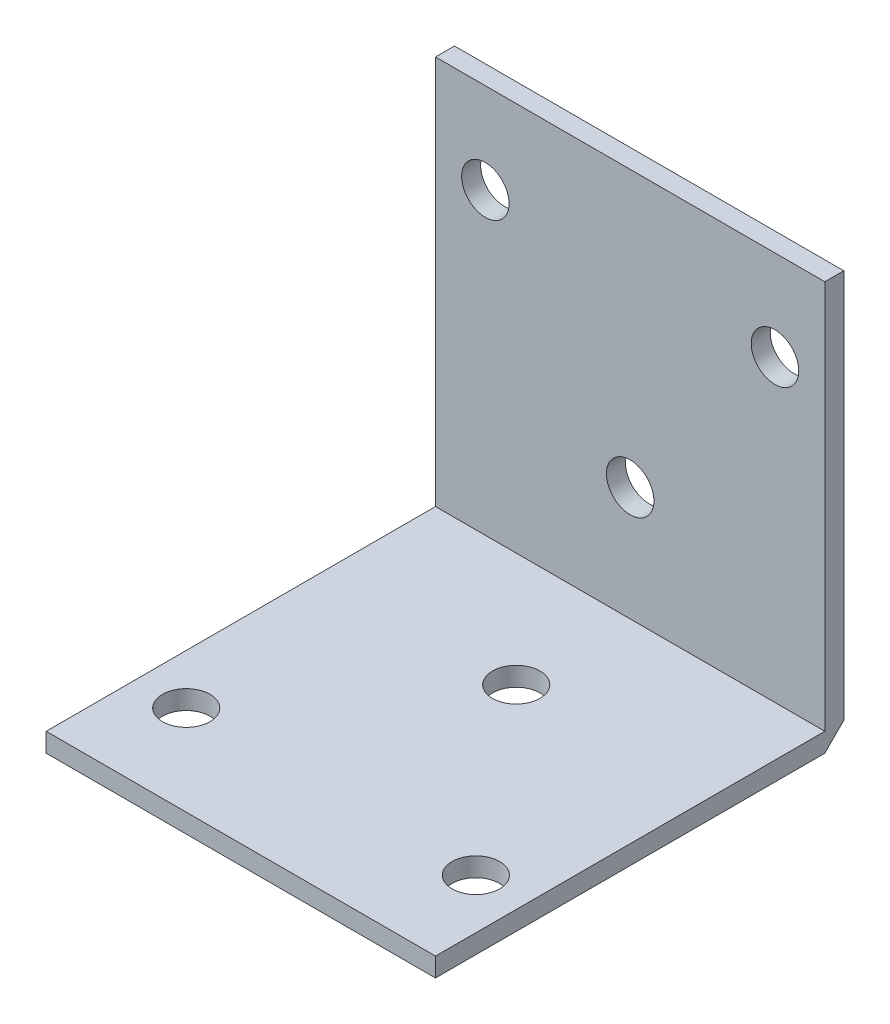
ISO-10303-21;
HEADER;
FILE_DESCRIPTION(('STEP AP214'),'2;1');
FILE_NAME('part.step','',(''),(''),'','','');
FILE_SCHEMA(('AUTOMOTIVE_DESIGN { 1 0 10303 214 1 1 1 1 }'));
ENDSEC;
DATA;
#1=APPLICATION_CONTEXT('core data for automotive mechanical design processes');
#2=APPLICATION_PROTOCOL_DEFINITION('international standard','automotive_design',2000,#1);
#3=PRODUCT_CONTEXT('',#1,'mechanical');
#4=PRODUCT('Part','Part','',(#3));
#5=PRODUCT_RELATED_PRODUCT_CATEGORY('part','',(#4));
#6=PRODUCT_DEFINITION_FORMATION('','',#4);
#7=PRODUCT_DEFINITION_CONTEXT('part definition',#1,'design');
#8=PRODUCT_DEFINITION('design','',#6,#7);
#9=PRODUCT_DEFINITION_SHAPE('','',#8);
#10=(LENGTH_UNIT() NAMED_UNIT(*) SI_UNIT(.MILLI.,.METRE.));
#11=(NAMED_UNIT(*) PLANE_ANGLE_UNIT() SI_UNIT($,.RADIAN.));
#12=(NAMED_UNIT(*) SI_UNIT($,.STERADIAN.) SOLID_ANGLE_UNIT());
#13=UNCERTAINTY_MEASURE_WITH_UNIT(LENGTH_MEASURE(1.E-05),#10,'distance_accuracy_value','');
#14=(GEOMETRIC_REPRESENTATION_CONTEXT(3) GLOBAL_UNCERTAINTY_ASSIGNED_CONTEXT((#13)) GLOBAL_UNIT_ASSIGNED_CONTEXT((#10,
#11,#12)) REPRESENTATION_CONTEXT('',''));
#15=CARTESIAN_POINT('',(0.,0.,0.));
#16=DIRECTION('',(0.,0.,1.));
#17=DIRECTION('',(1.,0.,0.));
#18=AXIS2_PLACEMENT_3D('',#15,#16,#17);
#19=CARTESIAN_POINT('',(0.,2.,0.));
#20=DIRECTION('',(0.,1.,0.));
#21=DIRECTION('',(0.,0.,1.));
#22=AXIS2_PLACEMENT_3D('',#19,#20,#21);
#23=PLANE('',#22);
#24=CARTESIAN_POINT('',(15.25,2.,11.));
#25=DIRECTION('',(0.,1.,0.));
#26=DIRECTION('',(0.,0.,1.));
#27=AXIS2_PLACEMENT_3D('',#24,#25,#26);
#28=CIRCLE('',#27,2.5);
#29=CARTESIAN_POINT('',(15.25,2.,13.5));
#30=VERTEX_POINT('',#29);
#31=EDGE_CURVE('E121',#30,#30,#28,.T.);
#32=ORIENTED_EDGE('',*,*,#31,.F.);
#33=EDGE_LOOP('',(#32));
#34=FACE_BOUND('',#33,.T.);
#35=DIRECTION('',(0.,0.,1.));
#36=VECTOR('',#35,1.);
#37=CARTESIAN_POINT('',(-20.5,2.,20.5));
#38=LINE('',#37,#36);
#39=CARTESIAN_POINT('',(-20.5,2.,-20.5));
#40=VERTEX_POINT('',#39);
#41=CARTESIAN_POINT('',(-20.5,2.,20.5));
#42=VERTEX_POINT('',#41);
#43=EDGE_CURVE('E92',#40,#42,#38,.T.);
#44=ORIENTED_EDGE('',*,*,#43,.T.);
#45=DIRECTION('',(1.,0.,0.));
#46=VECTOR('',#45,1.);
#47=CARTESIAN_POINT('',(20.5,2.,20.5));
#48=LINE('',#47,#46);
#49=CARTESIAN_POINT('',(20.5,2.,20.5));
#50=VERTEX_POINT('',#49);
#51=EDGE_CURVE('E82',#42,#50,#48,.T.);
#52=ORIENTED_EDGE('',*,*,#51,.T.);
#53=DIRECTION('',(0.,0.,-1.));
#54=VECTOR('',#53,1.);
#55=CARTESIAN_POINT('',(20.5,2.,20.5));
#56=LINE('',#55,#54);
#57=CARTESIAN_POINT('',(20.5,2.,-20.5));
#58=VERTEX_POINT('',#57);
#59=EDGE_CURVE('E91',#50,#58,#56,.T.);
#60=ORIENTED_EDGE('',*,*,#59,.T.);
#61=DIRECTION('',(-1.,0.,0.));
#62=VECTOR('',#61,1.);
#63=CARTESIAN_POINT('',(20.5,2.,-20.5));
#64=LINE('',#63,#62);
#65=EDGE_CURVE('E71',#58,#40,#64,.T.);
#66=ORIENTED_EDGE('',*,*,#65,.T.);
#67=EDGE_LOOP('',(#44,#52,#60,#66));
#68=FACE_BOUND('',#67,.T.);
#69=CARTESIAN_POINT('',(-15.25,2.,11.));
#70=DIRECTION('',(0.,1.,0.));
#71=DIRECTION('',(0.,0.,1.));
#72=AXIS2_PLACEMENT_3D('',#69,#70,#71);
#73=CIRCLE('',#72,2.5);
#74=CARTESIAN_POINT('',(-15.25,2.,13.5));
#75=VERTEX_POINT('',#74);
#76=EDGE_CURVE('E105',#75,#75,#73,.T.);
#77=ORIENTED_EDGE('',*,*,#76,.F.);
#78=EDGE_LOOP('',(#77));
#79=FACE_BOUND('',#78,.T.);
#80=CARTESIAN_POINT('',(0.,2.,-8.5));
#81=DIRECTION('',(0.,1.,0.));
#82=DIRECTION('',(0.,0.,1.));
#83=AXIS2_PLACEMENT_3D('',#80,#81,#82);
#84=CIRCLE('',#83,2.5);
#85=CARTESIAN_POINT('',(0.,2.,-6.));
#86=VERTEX_POINT('',#85);
#87=EDGE_CURVE('E126',#86,#86,#84,.T.);
#88=ORIENTED_EDGE('',*,*,#87,.F.);
#89=EDGE_LOOP('',(#88));
#90=FACE_BOUND('',#89,.T.);
#91=ADVANCED_FACE('F37',(#34,#68,#79,#90),#23,.T.);
#92=CARTESIAN_POINT('',(0.,0.,0.));
#93=DIRECTION('',(0.,1.,0.));
#94=DIRECTION('',(0.,0.,1.));
#95=AXIS2_PLACEMENT_3D('',#92,#93,#94);
#96=PLANE('',#95);
#97=DIRECTION('',(0.,0.,1.));
#98=VECTOR('',#97,1.);
#99=CARTESIAN_POINT('',(-20.5,0.,20.5));
#100=LINE('',#99,#98);
#101=CARTESIAN_POINT('',(-20.5,0.,-20.5));
#102=VERTEX_POINT('',#101);
#103=CARTESIAN_POINT('',(-20.5,0.,20.5));
#104=VERTEX_POINT('',#103);
#105=EDGE_CURVE('E100',#102,#104,#100,.T.);
#106=ORIENTED_EDGE('',*,*,#105,.F.);
#107=DIRECTION('',(-1.,0.,0.));
#108=VECTOR('',#107,1.);
#109=CARTESIAN_POINT('',(20.5,0.,-20.5));
#110=LINE('',#109,#108);
#111=CARTESIAN_POINT('',(20.5,0.,-20.5));
#112=VERTEX_POINT('',#111);
#113=EDGE_CURVE('E97',#112,#102,#110,.T.);
#114=ORIENTED_EDGE('',*,*,#113,.F.);
#115=DIRECTION('',(0.,0.,-1.));
#116=VECTOR('',#115,1.);
#117=CARTESIAN_POINT('',(20.5,0.,20.5));
#118=LINE('',#117,#116);
#119=CARTESIAN_POINT('',(20.5,0.,20.5));
#120=VERTEX_POINT('',#119);
#121=EDGE_CURVE('E107',#120,#112,#118,.T.);
#122=ORIENTED_EDGE('',*,*,#121,.F.);
#123=DIRECTION('',(1.,0.,0.));
#124=VECTOR('',#123,1.);
#125=CARTESIAN_POINT('',(20.5,0.,20.5));
#126=LINE('',#125,#124);
#127=EDGE_CURVE('E67',#104,#120,#126,.T.);
#128=ORIENTED_EDGE('',*,*,#127,.F.);
#129=EDGE_LOOP('',(#106,#114,#122,#128));
#130=FACE_BOUND('',#129,.T.);
#131=CARTESIAN_POINT('',(-15.25,0.,11.));
#132=DIRECTION('',(0.,1.,0.));
#133=DIRECTION('',(0.,0.,1.));
#134=AXIS2_PLACEMENT_3D('',#131,#132,#133);
#135=CIRCLE('',#134,2.5);
#136=CARTESIAN_POINT('',(-15.25,0.,13.5));
#137=VERTEX_POINT('',#136);
#138=EDGE_CURVE('E110',#137,#137,#135,.T.);
#139=ORIENTED_EDGE('',*,*,#138,.T.);
#140=EDGE_LOOP('',(#139));
#141=FACE_BOUND('',#140,.T.);
#142=CARTESIAN_POINT('',(15.25,0.,11.));
#143=DIRECTION('',(0.,1.,0.));
#144=DIRECTION('',(0.,0.,1.));
#145=AXIS2_PLACEMENT_3D('',#142,#143,#144);
#146=CIRCLE('',#145,2.5);
#147=CARTESIAN_POINT('',(15.25,0.,13.5));
#148=VERTEX_POINT('',#147);
#149=EDGE_CURVE('E123',#148,#148,#146,.T.);
#150=ORIENTED_EDGE('',*,*,#149,.T.);
#151=EDGE_LOOP('',(#150));
#152=FACE_BOUND('',#151,.T.);
#153=CARTESIAN_POINT('',(0.,0.,-8.5));
#154=DIRECTION('',(0.,1.,0.));
#155=DIRECTION('',(0.,0.,1.));
#156=AXIS2_PLACEMENT_3D('',#153,#154,#155);
#157=CIRCLE('',#156,2.5);
#158=CARTESIAN_POINT('',(0.,0.,-6.));
#159=VERTEX_POINT('',#158);
#160=EDGE_CURVE('E129',#159,#159,#157,.T.);
#161=ORIENTED_EDGE('',*,*,#160,.T.);
#162=EDGE_LOOP('',(#161));
#163=FACE_BOUND('',#162,.T.);
#164=ADVANCED_FACE('F214',(#130,#141,#152,#163),#96,.F.);
#165=CARTESIAN_POINT('',(-20.5,2.,20.5));
#166=DIRECTION('',(1.,0.,0.));
#167=DIRECTION('',(0.,0.,-1.));
#168=AXIS2_PLACEMENT_3D('',#165,#166,#167);
#169=PLANE('',#168);
#170=ORIENTED_EDGE('',*,*,#105,.T.);
#171=DIRECTION('',(0.,-1.,0.));
#172=VECTOR('',#171,1.);
#173=CARTESIAN_POINT('',(-20.5,2.,20.5));
#174=LINE('',#173,#172);
#175=EDGE_CURVE('E11',#42,#104,#174,.T.);
#176=ORIENTED_EDGE('',*,*,#175,.F.);
#177=ORIENTED_EDGE('',*,*,#43,.F.);
#178=DIRECTION('',(0.,1.,0.));
#179=VECTOR('',#178,1.);
#180=CARTESIAN_POINT('',(-20.5,2.,-20.5));
#181=LINE('',#180,#179);
#182=CARTESIAN_POINT('',(-20.5,43.,-20.5));
#183=VERTEX_POINT('',#182);
#184=EDGE_CURVE('E54',#40,#183,#181,.T.);
#185=ORIENTED_EDGE('',*,*,#184,.T.);
#186=DIRECTION('',(0.,0.,-1.));
#187=VECTOR('',#186,1.);
#188=CARTESIAN_POINT('',(-20.5,43.,-20.5));
#189=LINE('',#188,#187);
#190=CARTESIAN_POINT('',(-20.5,43.,-22.5));
#191=VERTEX_POINT('',#190);
#192=EDGE_CURVE('E147',#183,#191,#189,.T.);
#193=ORIENTED_EDGE('',*,*,#192,.T.);
#194=DIRECTION('',(0.,-1.,0.));
#195=VECTOR('',#194,1.);
#196=CARTESIAN_POINT('',(-20.5,2.,-22.5));
#197=LINE('',#196,#195);
#198=CARTESIAN_POINT('',(-20.5,2.,-22.5));
#199=VERTEX_POINT('',#198);
#200=EDGE_CURVE('E145',#191,#199,#197,.T.);
#201=ORIENTED_EDGE('',*,*,#200,.T.);
#202=DIRECTION('',(0.,-0.707106781186548,0.707106781186547));
#203=VECTOR('',#202,1.);
#204=CARTESIAN_POINT('',(-20.5,2.,-22.5));
#205=LINE('',#204,#203);
#206=EDGE_CURVE('E103',#199,#102,#205,.T.);
#207=ORIENTED_EDGE('',*,*,#206,.T.);
#208=EDGE_LOOP('',(#170,#176,#177,#185,#193,#201,#207));
#209=FACE_BOUND('',#208,.T.);
#210=ADVANCED_FACE('F39',(#209),#169,.F.);
#211=CARTESIAN_POINT('',(20.5,2.,20.5));
#212=DIRECTION('',(0.,0.,-1.));
#213=DIRECTION('',(-1.,0.,0.));
#214=AXIS2_PLACEMENT_3D('',#211,#212,#213);
#215=PLANE('',#214);
#216=ORIENTED_EDGE('',*,*,#127,.T.);
#217=DIRECTION('',(0.,-1.,0.));
#218=VECTOR('',#217,1.);
#219=CARTESIAN_POINT('',(20.5,2.,20.5));
#220=LINE('',#219,#218);
#221=EDGE_CURVE('E46',#50,#120,#220,.T.);
#222=ORIENTED_EDGE('',*,*,#221,.F.);
#223=ORIENTED_EDGE('',*,*,#51,.F.);
#224=ORIENTED_EDGE('',*,*,#175,.T.);
#225=EDGE_LOOP('',(#216,#222,#223,#224));
#226=FACE_BOUND('',#225,.T.);
#227=ADVANCED_FACE('F84',(#226),#215,.F.);
#228=CARTESIAN_POINT('',(20.5,2.,20.5));
#229=DIRECTION('',(-1.,0.,0.));
#230=DIRECTION('',(0.,0.,1.));
#231=AXIS2_PLACEMENT_3D('',#228,#229,#230);
#232=PLANE('',#231);
#233=ORIENTED_EDGE('',*,*,#121,.T.);
#234=DIRECTION('',(0.,-0.707106781186548,0.707106781186547));
#235=VECTOR('',#234,1.);
#236=CARTESIAN_POINT('',(20.5,2.,-22.5));
#237=LINE('',#236,#235);
#238=CARTESIAN_POINT('',(20.5,2.,-22.5));
#239=VERTEX_POINT('',#238);
#240=EDGE_CURVE('E138',#239,#112,#237,.T.);
#241=ORIENTED_EDGE('',*,*,#240,.F.);
#242=DIRECTION('',(0.,-1.,0.));
#243=VECTOR('',#242,1.);
#244=CARTESIAN_POINT('',(20.5,2.,-22.5));
#245=LINE('',#244,#243);
#246=CARTESIAN_POINT('',(20.5,43.,-22.5));
#247=VERTEX_POINT('',#246);
#248=EDGE_CURVE('E153',#247,#239,#245,.T.);
#249=ORIENTED_EDGE('',*,*,#248,.F.);
#250=DIRECTION('',(0.,0.,-1.));
#251=VECTOR('',#250,1.);
#252=CARTESIAN_POINT('',(20.5,43.,-20.5));
#253=LINE('',#252,#251);
#254=CARTESIAN_POINT('',(20.5,43.,-20.5));
#255=VERTEX_POINT('',#254);
#256=EDGE_CURVE('E156',#255,#247,#253,.T.);
#257=ORIENTED_EDGE('',*,*,#256,.F.);
#258=DIRECTION('',(0.,1.,0.));
#259=VECTOR('',#258,1.);
#260=CARTESIAN_POINT('',(20.5,0.,-20.5));
#261=LINE('',#260,#259);
#262=EDGE_CURVE('E144',#58,#255,#261,.T.);
#263=ORIENTED_EDGE('',*,*,#262,.F.);
#264=ORIENTED_EDGE('',*,*,#59,.F.);
#265=ORIENTED_EDGE('',*,*,#221,.T.);
#266=EDGE_LOOP('',(#233,#241,#249,#257,#263,#264,#265));
#267=FACE_BOUND('',#266,.T.);
#268=ADVANCED_FACE('F226',(#267),#232,.F.);
#269=CARTESIAN_POINT('',(-15.25,2.,11.));
#270=DIRECTION('',(0.,-1.,0.));
#271=DIRECTION('',(0.,0.,-1.));
#272=AXIS2_PLACEMENT_3D('',#269,#270,#271);
#273=CYLINDRICAL_SURFACE('',#272,2.5);
#274=ORIENTED_EDGE('',*,*,#76,.T.);
#275=EDGE_LOOP('',(#274));
#276=FACE_BOUND('',#275,.T.);
#277=ORIENTED_EDGE('',*,*,#138,.F.);
#278=EDGE_LOOP('',(#277));
#279=FACE_BOUND('',#278,.T.);
#280=ADVANCED_FACE('F223',(#276,#279),#273,.F.);
#281=CARTESIAN_POINT('',(15.25,2.,11.));
#282=DIRECTION('',(0.,-1.,0.));
#283=DIRECTION('',(0.,0.,-1.));
#284=AXIS2_PLACEMENT_3D('',#281,#282,#283);
#285=CYLINDRICAL_SURFACE('',#284,2.5);
#286=ORIENTED_EDGE('',*,*,#31,.T.);
#287=EDGE_LOOP('',(#286));
#288=FACE_BOUND('',#287,.T.);
#289=ORIENTED_EDGE('',*,*,#149,.F.);
#290=EDGE_LOOP('',(#289));
#291=FACE_BOUND('',#290,.T.);
#292=ADVANCED_FACE('F253',(#288,#291),#285,.F.);
#293=CARTESIAN_POINT('',(0.,2.,-8.5));
#294=DIRECTION('',(0.,-1.,0.));
#295=DIRECTION('',(0.,0.,-1.));
#296=AXIS2_PLACEMENT_3D('',#293,#294,#295);
#297=CYLINDRICAL_SURFACE('',#296,2.5);
#298=ORIENTED_EDGE('',*,*,#87,.T.);
#299=EDGE_LOOP('',(#298));
#300=FACE_BOUND('',#299,.T.);
#301=ORIENTED_EDGE('',*,*,#160,.F.);
#302=EDGE_LOOP('',(#301));
#303=FACE_BOUND('',#302,.T.);
#304=ADVANCED_FACE('F192',(#300,#303),#297,.F.);
#305=CARTESIAN_POINT('',(20.5,2.,-20.5));
#306=DIRECTION('',(0.,0.,1.));
#307=DIRECTION('',(1.,0.,0.));
#308=AXIS2_PLACEMENT_3D('',#305,#306,#307);
#309=PLANE('',#308);
#310=CARTESIAN_POINT('',(-15.25,33.5,-20.5));
#311=DIRECTION('',(0.,0.,1.));
#312=DIRECTION('',(1.,0.,0.));
#313=AXIS2_PLACEMENT_3D('',#310,#311,#312);
#314=CIRCLE('',#313,2.5);
#315=CARTESIAN_POINT('',(-12.75,33.5,-20.5));
#316=VERTEX_POINT('',#315);
#317=EDGE_CURVE('E172',#316,#316,#314,.T.);
#318=ORIENTED_EDGE('',*,*,#317,.F.);
#319=EDGE_LOOP('',(#318));
#320=FACE_BOUND('',#319,.T.);
#321=CARTESIAN_POINT('',(15.25,33.5,-20.5));
#322=DIRECTION('',(0.,0.,1.));
#323=DIRECTION('',(1.,0.,0.));
#324=AXIS2_PLACEMENT_3D('',#321,#322,#323);
#325=CIRCLE('',#324,2.5);
#326=CARTESIAN_POINT('',(17.75,33.5,-20.5));
#327=VERTEX_POINT('',#326);
#328=EDGE_CURVE('E166',#327,#327,#325,.T.);
#329=ORIENTED_EDGE('',*,*,#328,.F.);
#330=EDGE_LOOP('',(#329));
#331=FACE_BOUND('',#330,.T.);
#332=CARTESIAN_POINT('',(0.,14.,-20.5));
#333=DIRECTION('',(0.,0.,1.));
#334=DIRECTION('',(1.,0.,0.));
#335=AXIS2_PLACEMENT_3D('',#332,#333,#334);
#336=CIRCLE('',#335,2.5);
#337=CARTESIAN_POINT('',(2.5,14.,-20.5));
#338=VERTEX_POINT('',#337);
#339=EDGE_CURVE('E160',#338,#338,#336,.T.);
#340=ORIENTED_EDGE('',*,*,#339,.F.);
#341=EDGE_LOOP('',(#340));
#342=FACE_BOUND('',#341,.T.);
#343=ORIENTED_EDGE('',*,*,#65,.F.);
#344=ORIENTED_EDGE('',*,*,#262,.T.);
#345=DIRECTION('',(-1.,0.,0.));
#346=VECTOR('',#345,1.);
#347=CARTESIAN_POINT('',(20.5,43.,-20.5));
#348=LINE('',#347,#346);
#349=EDGE_CURVE('E135',#255,#183,#348,.T.);
#350=ORIENTED_EDGE('',*,*,#349,.T.);
#351=ORIENTED_EDGE('',*,*,#184,.F.);
#352=EDGE_LOOP('',(#343,#344,#350,#351));
#353=FACE_BOUND('',#352,.T.);
#354=ADVANCED_FACE('F188',(#320,#331,#342,#353),#309,.T.);
#355=CARTESIAN_POINT('',(20.5,2.,-22.5));
#356=DIRECTION('',(0.,-0.707106781186547,-0.707106781186548));
#357=DIRECTION('',(0.,0.707106781186548,-0.707106781186547));
#358=AXIS2_PLACEMENT_3D('',#355,#356,#357);
#359=PLANE('',#358);
#360=ORIENTED_EDGE('',*,*,#206,.F.);
#361=DIRECTION('',(-1.,0.,0.));
#362=VECTOR('',#361,1.);
#363=CARTESIAN_POINT('',(20.5,2.,-22.5));
#364=LINE('',#363,#362);
#365=EDGE_CURVE('E132',#239,#199,#364,.T.);
#366=ORIENTED_EDGE('',*,*,#365,.F.);
#367=ORIENTED_EDGE('',*,*,#240,.T.);
#368=ORIENTED_EDGE('',*,*,#113,.T.);
#369=EDGE_LOOP('',(#360,#366,#367,#368));
#370=FACE_BOUND('',#369,.T.);
#371=ADVANCED_FACE('F191',(#370),#359,.T.);
#372=CARTESIAN_POINT('',(20.5,2.,-22.5));
#373=DIRECTION('',(0.,0.,-1.));
#374=DIRECTION('',(-1.,0.,0.));
#375=AXIS2_PLACEMENT_3D('',#372,#373,#374);
#376=PLANE('',#375);
#377=CARTESIAN_POINT('',(-15.25,33.5,-22.5));
#378=DIRECTION('',(0.,0.,1.));
#379=DIRECTION('',(1.,0.,0.));
#380=AXIS2_PLACEMENT_3D('',#377,#378,#379);
#381=CIRCLE('',#380,2.5);
#382=CARTESIAN_POINT('',(-12.75,33.5,-22.5));
#383=VERTEX_POINT('',#382);
#384=EDGE_CURVE('E151',#383,#383,#381,.T.);
#385=ORIENTED_EDGE('',*,*,#384,.T.);
#386=EDGE_LOOP('',(#385));
#387=FACE_BOUND('',#386,.T.);
#388=CARTESIAN_POINT('',(15.25,33.5,-22.5));
#389=DIRECTION('',(0.,0.,1.));
#390=DIRECTION('',(1.,0.,0.));
#391=AXIS2_PLACEMENT_3D('',#388,#389,#390);
#392=CIRCLE('',#391,2.5);
#393=CARTESIAN_POINT('',(17.75,33.5,-22.5));
#394=VERTEX_POINT('',#393);
#395=EDGE_CURVE('E169',#394,#394,#392,.T.);
#396=ORIENTED_EDGE('',*,*,#395,.T.);
#397=EDGE_LOOP('',(#396));
#398=FACE_BOUND('',#397,.T.);
#399=CARTESIAN_POINT('',(0.,14.,-22.5));
#400=DIRECTION('',(0.,0.,1.));
#401=DIRECTION('',(1.,0.,0.));
#402=AXIS2_PLACEMENT_3D('',#399,#400,#401);
#403=CIRCLE('',#402,2.5);
#404=CARTESIAN_POINT('',(2.5,14.,-22.5));
#405=VERTEX_POINT('',#404);
#406=EDGE_CURVE('E163',#405,#405,#403,.T.);
#407=ORIENTED_EDGE('',*,*,#406,.T.);
#408=EDGE_LOOP('',(#407));
#409=FACE_BOUND('',#408,.T.);
#410=ORIENTED_EDGE('',*,*,#200,.F.);
#411=DIRECTION('',(-1.,0.,0.));
#412=VECTOR('',#411,1.);
#413=CARTESIAN_POINT('',(20.5,43.,-22.5));
#414=LINE('',#413,#412);
#415=EDGE_CURVE('E137',#247,#191,#414,.T.);
#416=ORIENTED_EDGE('',*,*,#415,.F.);
#417=ORIENTED_EDGE('',*,*,#248,.T.);
#418=ORIENTED_EDGE('',*,*,#365,.T.);
#419=EDGE_LOOP('',(#410,#416,#417,#418));
#420=FACE_BOUND('',#419,.T.);
#421=ADVANCED_FACE('F178',(#387,#398,#409,#420),#376,.T.);
#422=CARTESIAN_POINT('',(20.5,43.,-20.5));
#423=DIRECTION('',(0.,1.,0.));
#424=DIRECTION('',(0.,0.,1.));
#425=AXIS2_PLACEMENT_3D('',#422,#423,#424);
#426=PLANE('',#425);
#427=ORIENTED_EDGE('',*,*,#192,.F.);
#428=ORIENTED_EDGE('',*,*,#349,.F.);
#429=ORIENTED_EDGE('',*,*,#256,.T.);
#430=ORIENTED_EDGE('',*,*,#415,.T.);
#431=EDGE_LOOP('',(#427,#428,#429,#430));
#432=FACE_BOUND('',#431,.T.);
#433=ADVANCED_FACE('F200',(#432),#426,.T.);
#434=CARTESIAN_POINT('',(0.,14.,-22.5));
#435=DIRECTION('',(0.,0.,1.));
#436=DIRECTION('',(1.,0.,0.));
#437=AXIS2_PLACEMENT_3D('',#434,#435,#436);
#438=CYLINDRICAL_SURFACE('',#437,2.5);
#439=ORIENTED_EDGE('',*,*,#406,.F.);
#440=EDGE_LOOP('',(#439));
#441=FACE_BOUND('',#440,.T.);
#442=ORIENTED_EDGE('',*,*,#339,.T.);
#443=EDGE_LOOP('',(#442));
#444=FACE_BOUND('',#443,.T.);
#445=ADVANCED_FACE('F198',(#441,#444),#438,.F.);
#446=CARTESIAN_POINT('',(15.25,33.5,-22.5));
#447=DIRECTION('',(0.,0.,1.));
#448=DIRECTION('',(1.,0.,0.));
#449=AXIS2_PLACEMENT_3D('',#446,#447,#448);
#450=CYLINDRICAL_SURFACE('',#449,2.5);
#451=ORIENTED_EDGE('',*,*,#395,.F.);
#452=EDGE_LOOP('',(#451));
#453=FACE_BOUND('',#452,.T.);
#454=ORIENTED_EDGE('',*,*,#328,.T.);
#455=EDGE_LOOP('',(#454));
#456=FACE_BOUND('',#455,.T.);
#457=ADVANCED_FACE('F184',(#453,#456),#450,.F.);
#458=CARTESIAN_POINT('',(-15.25,33.5,-22.5));
#459=DIRECTION('',(0.,0.,1.));
#460=DIRECTION('',(1.,0.,0.));
#461=AXIS2_PLACEMENT_3D('',#458,#459,#460);
#462=CYLINDRICAL_SURFACE('',#461,2.5);
#463=ORIENTED_EDGE('',*,*,#384,.F.);
#464=EDGE_LOOP('',(#463));
#465=FACE_BOUND('',#464,.T.);
#466=ORIENTED_EDGE('',*,*,#317,.T.);
#467=EDGE_LOOP('',(#466));
#468=FACE_BOUND('',#467,.T.);
#469=ADVANCED_FACE('F181',(#465,#468),#462,.F.);
#470=CLOSED_SHELL('',(#91,#164,#210,#227,#268,#280,#292,#304,#354,#371,#421,#433,#445,#457,#469));
#471=MANIFOLD_SOLID_BREP('B2',#470);
#472=ADVANCED_BREP_SHAPE_REPRESENTATION('',(#18,#471),#14);
#473=SHAPE_DEFINITION_REPRESENTATION(#9,#472);
ENDSEC;
END-ISO-10303-21;
